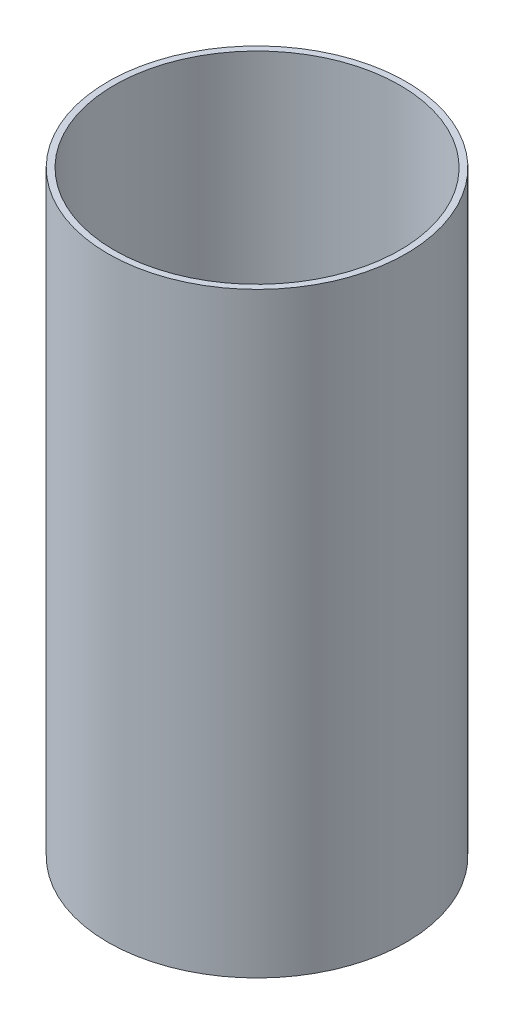
ISO-10303-21;
HEADER;
FILE_DESCRIPTION(('STEP AP214'),'2;1');
FILE_NAME('part.step','',(''),(''),'','','');
FILE_SCHEMA(('AUTOMOTIVE_DESIGN { 1 0 10303 214 1 1 1 1 }'));
ENDSEC;
DATA;
#1=APPLICATION_CONTEXT('core data for automotive mechanical design processes');
#2=APPLICATION_PROTOCOL_DEFINITION('international standard','automotive_design',2000,#1);
#3=PRODUCT_CONTEXT('',#1,'mechanical');
#4=PRODUCT('Part','Part','',(#3));
#5=PRODUCT_RELATED_PRODUCT_CATEGORY('part','',(#4));
#6=PRODUCT_DEFINITION_FORMATION('','',#4);
#7=PRODUCT_DEFINITION_CONTEXT('part definition',#1,'design');
#8=PRODUCT_DEFINITION('design','',#6,#7);
#9=PRODUCT_DEFINITION_SHAPE('','',#8);
#10=(LENGTH_UNIT() NAMED_UNIT(*) SI_UNIT(.MILLI.,.METRE.));
#11=(NAMED_UNIT(*) PLANE_ANGLE_UNIT() SI_UNIT($,.RADIAN.));
#12=(NAMED_UNIT(*) SI_UNIT($,.STERADIAN.) SOLID_ANGLE_UNIT());
#13=UNCERTAINTY_MEASURE_WITH_UNIT(LENGTH_MEASURE(1.E-05),#10,'distance_accuracy_value','');
#14=(GEOMETRIC_REPRESENTATION_CONTEXT(3) GLOBAL_UNCERTAINTY_ASSIGNED_CONTEXT((#13)) GLOBAL_UNIT_ASSIGNED_CONTEXT((#10,
#11,#12)) REPRESENTATION_CONTEXT('',''));
#15=CARTESIAN_POINT('',(0.,0.,0.));
#16=DIRECTION('',(0.,0.,1.));
#17=DIRECTION('',(1.,0.,0.));
#18=AXIS2_PLACEMENT_3D('',#15,#16,#17);
#19=CARTESIAN_POINT('',(0.,304.8,0.));
#20=DIRECTION('',(0.,1.,0.));
#21=DIRECTION('',(0.,0.,1.));
#22=AXIS2_PLACEMENT_3D('',#19,#20,#21);
#23=PLANE('',#22);
#24=CARTESIAN_POINT('',(0.,304.8,0.));
#25=DIRECTION('',(0.,1.,0.));
#26=DIRECTION('',(0.,0.,1.));
#27=AXIS2_PLACEMENT_3D('',#24,#25,#26);
#28=CIRCLE('',#27,76.2);
#29=CARTESIAN_POINT('',(0.,304.8,76.2));
#30=VERTEX_POINT('',#29);
#31=EDGE_CURVE('E10',#30,#30,#28,.T.);
#32=ORIENTED_EDGE('',*,*,#31,.T.);
#33=EDGE_LOOP('',(#32));
#34=FACE_BOUND('',#33,.T.);
#35=CARTESIAN_POINT('',(0.,304.8,0.));
#36=DIRECTION('',(0.,1.,0.));
#37=DIRECTION('',(0.,0.,1.));
#38=AXIS2_PLACEMENT_3D('',#35,#36,#37);
#39=CIRCLE('',#38,73.025);
#40=CARTESIAN_POINT('',(0.,304.8,73.025));
#41=VERTEX_POINT('',#40);
#42=EDGE_CURVE('E43',#41,#41,#39,.T.);
#43=ORIENTED_EDGE('',*,*,#42,.F.);
#44=EDGE_LOOP('',(#43));
#45=FACE_BOUND('',#44,.T.);
#46=ADVANCED_FACE('F32',(#34,#45),#23,.T.);
#47=CARTESIAN_POINT('',(0.,0.,0.));
#48=DIRECTION('',(0.,1.,0.));
#49=DIRECTION('',(0.,0.,1.));
#50=AXIS2_PLACEMENT_3D('',#47,#48,#49);
#51=PLANE('',#50);
#52=CARTESIAN_POINT('',(0.,0.,0.));
#53=DIRECTION('',(0.,1.,0.));
#54=DIRECTION('',(0.,0.,1.));
#55=AXIS2_PLACEMENT_3D('',#52,#53,#54);
#56=CIRCLE('',#55,76.2);
#57=CARTESIAN_POINT('',(0.,0.,76.2));
#58=VERTEX_POINT('',#57);
#59=EDGE_CURVE('E36',#58,#58,#56,.T.);
#60=ORIENTED_EDGE('',*,*,#59,.F.);
#61=EDGE_LOOP('',(#60));
#62=FACE_BOUND('',#61,.T.);
#63=CARTESIAN_POINT('',(0.,0.,0.));
#64=DIRECTION('',(0.,1.,0.));
#65=DIRECTION('',(0.,0.,1.));
#66=AXIS2_PLACEMENT_3D('',#63,#64,#65);
#67=CIRCLE('',#66,73.025);
#68=CARTESIAN_POINT('',(0.,0.,73.025));
#69=VERTEX_POINT('',#68);
#70=EDGE_CURVE('E45',#69,#69,#67,.T.);
#71=ORIENTED_EDGE('',*,*,#70,.T.);
#72=EDGE_LOOP('',(#71));
#73=FACE_BOUND('',#72,.T.);
#74=ADVANCED_FACE('F55',(#62,#73),#51,.F.);
#75=CARTESIAN_POINT('',(0.,304.8,0.));
#76=DIRECTION('',(0.,-1.,0.));
#77=DIRECTION('',(0.,0.,-1.));
#78=AXIS2_PLACEMENT_3D('',#75,#76,#77);
#79=CYLINDRICAL_SURFACE('',#78,76.2);
#80=ORIENTED_EDGE('',*,*,#31,.F.);
#81=EDGE_LOOP('',(#80));
#82=FACE_BOUND('',#81,.T.);
#83=ORIENTED_EDGE('',*,*,#59,.T.);
#84=EDGE_LOOP('',(#83));
#85=FACE_BOUND('',#84,.T.);
#86=ADVANCED_FACE('F34',(#82,#85),#79,.T.);
#87=CARTESIAN_POINT('',(0.,304.8,0.));
#88=DIRECTION('',(0.,-1.,0.));
#89=DIRECTION('',(0.,0.,-1.));
#90=AXIS2_PLACEMENT_3D('',#87,#88,#89);
#91=CYLINDRICAL_SURFACE('',#90,73.025);
#92=ORIENTED_EDGE('',*,*,#42,.T.);
#93=EDGE_LOOP('',(#92));
#94=FACE_BOUND('',#93,.T.);
#95=ORIENTED_EDGE('',*,*,#70,.F.);
#96=EDGE_LOOP('',(#95));
#97=FACE_BOUND('',#96,.T.);
#98=ADVANCED_FACE('F51',(#94,#97),#91,.F.);
#99=CLOSED_SHELL('',(#46,#74,#86,#98));
#100=MANIFOLD_SOLID_BREP('B2',#99);
#101=ADVANCED_BREP_SHAPE_REPRESENTATION('',(#18,#100),#14);
#102=SHAPE_DEFINITION_REPRESENTATION(#9,#101);
ENDSEC;
END-ISO-10303-21;
